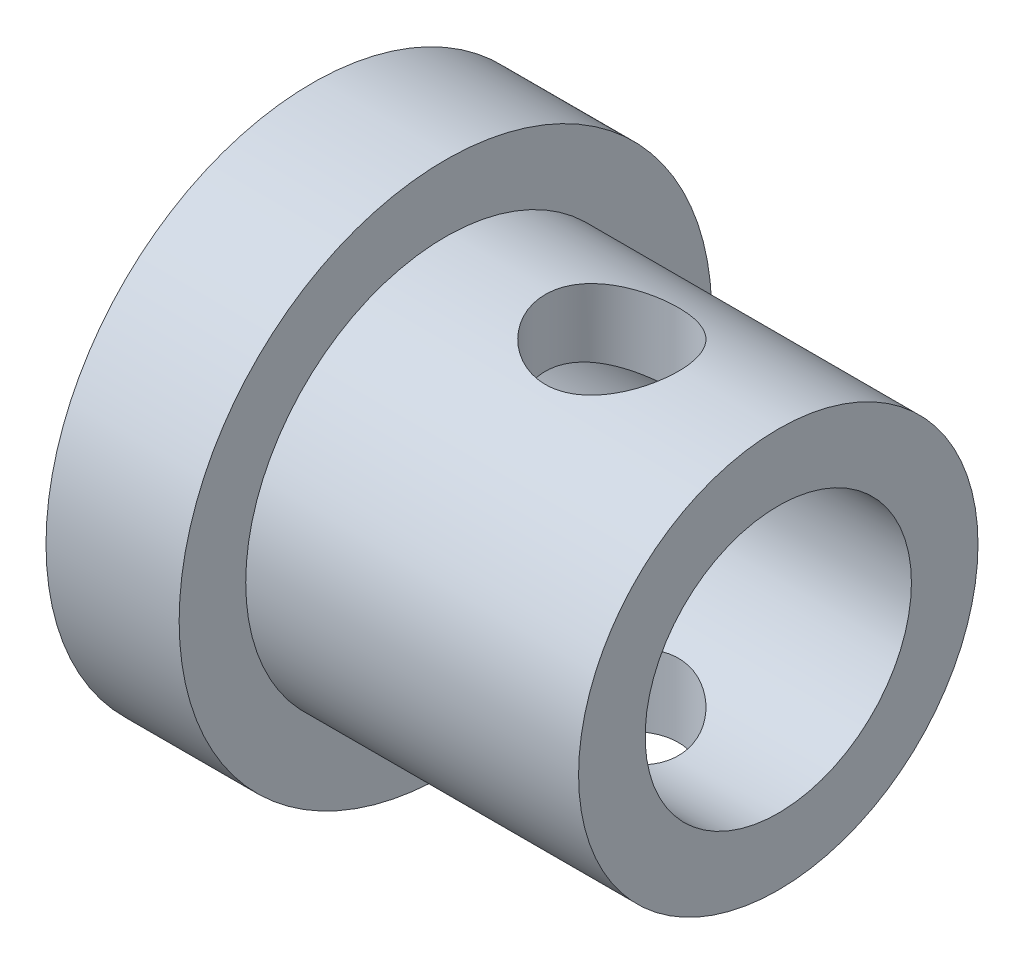
ISO-10303-21;
HEADER;
FILE_DESCRIPTION(('STEP AP214'),'2;1');
FILE_NAME('part.step','',(''),(''),'','','');
FILE_SCHEMA(('AUTOMOTIVE_DESIGN { 1 0 10303 214 1 1 1 1 }'));
ENDSEC;
DATA;
#1=APPLICATION_CONTEXT('core data for automotive mechanical design processes');
#2=APPLICATION_PROTOCOL_DEFINITION('international standard','automotive_design',2000,#1);
#3=PRODUCT_CONTEXT('',#1,'mechanical');
#4=PRODUCT('Part','Part','',(#3));
#5=PRODUCT_RELATED_PRODUCT_CATEGORY('part','',(#4));
#6=PRODUCT_DEFINITION_FORMATION('','',#4);
#7=PRODUCT_DEFINITION_CONTEXT('part definition',#1,'design');
#8=PRODUCT_DEFINITION('design','',#6,#7);
#9=PRODUCT_DEFINITION_SHAPE('','',#8);
#10=(LENGTH_UNIT() NAMED_UNIT(*) SI_UNIT(.MILLI.,.METRE.));
#11=(NAMED_UNIT(*) PLANE_ANGLE_UNIT() SI_UNIT($,.RADIAN.));
#12=(NAMED_UNIT(*) SI_UNIT($,.STERADIAN.) SOLID_ANGLE_UNIT());
#13=UNCERTAINTY_MEASURE_WITH_UNIT(LENGTH_MEASURE(1.E-05),#10,'distance_accuracy_value','');
#14=(GEOMETRIC_REPRESENTATION_CONTEXT(3) GLOBAL_UNCERTAINTY_ASSIGNED_CONTEXT((#13)) GLOBAL_UNIT_ASSIGNED_CONTEXT((#10,
#11,#12)) REPRESENTATION_CONTEXT('',''));
#15=CARTESIAN_POINT('',(0.,0.,0.));
#16=DIRECTION('',(0.,0.,1.));
#17=DIRECTION('',(1.,0.,0.));
#18=AXIS2_PLACEMENT_3D('',#15,#16,#17);
#19=CARTESIAN_POINT('',(3.5,0.,0.));
#20=DIRECTION('',(-1.,0.,0.));
#21=DIRECTION('',(0.,0.,1.));
#22=AXIS2_PLACEMENT_3D('',#19,#20,#21);
#23=CYLINDRICAL_SURFACE('',#22,3.);
#24=CARTESIAN_POINT('',(1.,-2.82842712474619,1.));
#25=CARTESIAN_POINT('',(1.05446817481068,-2.82842694532735,1.0000002579478));
#26=CARTESIAN_POINT('',(1.10893479977153,-2.83001769372806,0.99553478369814));
#27=CARTESIAN_POINT('',(1.21625442095062,-2.8361757417458,0.977851131702564));
#28=CARTESIAN_POINT('',(1.26910714986394,-2.8407435316722,0.964631512170673));
#29=CARTESIAN_POINT('',(1.37162689301281,-2.85228203663888,0.929955485680262));
#30=CARTESIAN_POINT('',(1.42129992944688,-2.8592480396464,0.908515221402));
#31=CARTESIAN_POINT('',(1.5163600485438,-2.87479122017008,0.858061628442627));
#32=CARTESIAN_POINT('',(1.5617461825525,-2.88336875305432,0.829046628860522));
#33=CARTESIAN_POINT('',(1.64871996233949,-2.90154489405589,0.763051146442527));
#34=CARTESIAN_POINT('',(1.69011542867204,-2.91116894844139,0.725824341377825));
#35=CARTESIAN_POINT('',(1.76620680122432,-2.93013864801508,0.644987667214489));
#36=CARTESIAN_POINT('',(1.80090163158228,-2.93948424829099,0.601376775052401));
#37=CARTESIAN_POINT('',(1.86347889732968,-2.95713866921658,0.507604507964983));
#38=CARTESIAN_POINT('',(1.89115997061798,-2.96541407701568,0.457301911224518));
#39=CARTESIAN_POINT('',(1.93759158512749,-2.97969586771021,0.352431222987481));
#40=CARTESIAN_POINT('',(1.9563445331769,-2.98570286203012,0.297864285687214));
#41=CARTESIAN_POINT('',(1.9837358546324,-2.99459075431897,0.188028817433492));
#42=CARTESIAN_POINT('',(1.99270344625701,-2.99757314777558,0.132850754852967));
#43=CARTESIAN_POINT('',(2.00131629336066,-3.00043608218249,0.0216978748240906));
#44=CARTESIAN_POINT('',(2.00096395165242,-3.00031742262891,-0.0342767335438934));
#45=CARTESIAN_POINT('',(1.99115574543397,-2.99706039618736,-0.143103515193818));
#46=CARTESIAN_POINT('',(1.98205747152549,-2.99404064755135,-0.195992048591668));
#47=CARTESIAN_POINT('',(1.95560701901955,-2.98546967339714,-0.299443438822161));
#48=CARTESIAN_POINT('',(1.93825428102024,-2.97991827631115,-0.350006137779176));
#49=CARTESIAN_POINT('',(1.89557868269387,-2.96675670293292,-0.448152474842014));
#50=CARTESIAN_POINT('',(1.87015406145322,-2.9591204252427,-0.495688220968999));
#51=CARTESIAN_POINT('',(1.81214029455161,-2.94258393038665,-0.58592432552717));
#52=CARTESIAN_POINT('',(1.77954915667336,-2.93368336200518,-0.62862333438477));
#53=CARTESIAN_POINT('',(1.70632560653926,-2.9150619185089,-0.710100866551907));
#54=CARTESIAN_POINT('',(1.66538684215456,-2.90532215172667,-0.748600157067556));
#55=CARTESIAN_POINT('',(1.57755127427734,-2.88647335245111,-0.81827725959589));
#56=CARTESIAN_POINT('',(1.53065355428676,-2.8773644173145,-0.849453943273005));
#57=CARTESIAN_POINT('',(1.43134637438458,-2.86070525135531,-0.903987455042732));
#58=CARTESIAN_POINT('',(1.37886786863219,-2.85317909338821,-0.927226463651049));
#59=CARTESIAN_POINT('',(1.27042860573374,-2.84081650878299,-0.964443193299507));
#60=CARTESIAN_POINT('',(1.21446931877818,-2.83597895501223,-0.978424795755529));
#61=CARTESIAN_POINT('',(1.10336164459938,-2.8297963630207,-0.996161282090474));
#62=CARTESIAN_POINT('',(1.04829057525428,-2.82830360315139,-1.00034909550575));
#63=CARTESIAN_POINT('',(0.938223850882962,-2.828566720628,-0.999605438911605));
#64=CARTESIAN_POINT('',(0.883228183975239,-2.83032200792768,-0.99467562522726));
#65=CARTESIAN_POINT('',(0.776843034288837,-2.83673618089379,-0.97622565155183));
#66=CARTESIAN_POINT('',(0.725394569849359,-2.84129325440593,-0.963006393980555));
#67=CARTESIAN_POINT('',(0.625456393760615,-2.8526855367127,-0.928713862560596));
#68=CARTESIAN_POINT('',(0.576967208409165,-2.85952114934907,-0.907639196363457));
#69=CARTESIAN_POINT('',(0.482619579153058,-2.87496877595718,-0.8574743407389));
#70=CARTESIAN_POINT('',(0.436893357358213,-2.8836302566561,-0.828151118358487));
#71=CARTESIAN_POINT('',(0.350853947616265,-2.90165768730984,-0.762585630557568));
#72=CARTESIAN_POINT('',(0.310542361338776,-2.911023844438,-0.726341325498784));
#73=CARTESIAN_POINT('',(0.234472015909365,-2.92995038637844,-0.645891705900322));
#74=CARTESIAN_POINT('',(0.199025609981151,-2.93949843577895,-0.601387270546651));
#75=CARTESIAN_POINT('',(0.136083857651955,-2.9572685161311,-0.506827291400257));
#76=CARTESIAN_POINT('',(0.108588228837575,-2.96549059417695,-0.456771944864552));
#77=CARTESIAN_POINT('',(0.062579895138285,-2.97964405810603,-0.352779862432295));
#78=CARTESIAN_POINT('',(0.0440087228519343,-2.98559030004531,-0.298871123321196));
#79=CARTESIAN_POINT('',(0.0162722579398949,-2.99458610837774,-0.188458465846016));
#80=CARTESIAN_POINT('',(0.00710357011949681,-2.99763672034018,-0.131955491953889));
#81=CARTESIAN_POINT('',(-0.00126207760564187,-3.00041863236257,-0.0208153358600406));
#82=CARTESIAN_POINT('',(-0.000907453932375802,-3.00029920089441,0.0337847239200191));
#83=CARTESIAN_POINT('',(0.00865730814640729,-2.99712196519396,0.142111145000174));
#84=CARTESIAN_POINT('',(0.0178667281527638,-2.99406439933567,0.195837576819055));
#85=CARTESIAN_POINT('',(0.0445822345759675,-2.98540914954421,0.300042119432061));
#86=CARTESIAN_POINT('',(0.0619542153529519,-2.9798525836118,0.350558270912795));
#87=CARTESIAN_POINT('',(0.104377531097136,-2.96677160704464,0.44797835093979));
#88=CARTESIAN_POINT('',(0.129430255196942,-2.95924684047901,0.49488162414241));
#89=CARTESIAN_POINT('',(0.187569512102081,-2.94265868828001,0.585634016308809));
#90=CARTESIAN_POINT('',(0.22091868538192,-2.93354872492381,0.629306251557697));
#91=CARTESIAN_POINT('',(0.294257391155915,-2.91492988791425,0.710581026272338));
#92=CARTESIAN_POINT('',(0.334249042261682,-2.90542088771397,0.748181621624259));
#93=CARTESIAN_POINT('',(0.421609355588035,-2.88663279827365,0.817741808833464));
#94=CARTESIAN_POINT('',(0.469205510980768,-2.87737727995345,0.849422965999216));
#95=CARTESIAN_POINT('',(0.569334426898652,-2.86060193316303,0.904314343299799));
#96=CARTESIAN_POINT('',(0.621865893014244,-2.8530816513617,0.927526776814559));
#97=CARTESIAN_POINT('',(0.727961824023833,-2.84101334230535,0.963843828206626));
#98=CARTESIAN_POINT('',(0.781372263565722,-2.83634632944799,0.977357909163268));
#99=CARTESIAN_POINT('',(0.889856050515475,-2.83005383613939,0.995434320161694));
#100=CARTESIAN_POINT('',(0.944928817435749,-2.82842730615135,0.999999739196502));
#101=CARTESIAN_POINT('',(1.,-2.82842712474619,1.));
#102=B_SPLINE_CURVE_WITH_KNOTS('',3,(#24,#25,#26,#27,#28,#29,#30,#31,#32,#33,#34,#35,#36,#37,
#38,#39,#40,#41,#42,#43,#44,#45,#46,#47,#48,#49,#50,#51,#52,#53,#54,#55,#56,#57,#58,#59,#60,#61,
#62,#63,#64,#65,#66,#67,#68,#69,#70,#71,#72,#73,#74,#75,#76,#77,#78,#79,#80,#81,#82,#83,#84,#85,
#86,#87,#88,#89,#90,#91,#92,#93,#94,#95,#96,#97,#98,#99,#100,#101),.UNSPECIFIED.,.T.,.F.,(4,2,2,
2,2,2,2,2,2,2,2,2,2,2,2,2,2,2,2,2,2,2,2,2,2,2,2,2,2,2,2,2,2,2,2,2,2,2,4),(0.,0.163200584775417,
0.32642805496888,0.489336627454544,0.652281166139159,0.821013374229398,0.989772651673597,
1.16293506139029,1.33605076382161,1.50314318760306,1.67019253297699,1.83069004820941,
1.99119844184608,2.15381654855707,2.31647991869394,2.48680174359289,2.65714979607478,
2.82992639837376,3.00263051349689,3.16754291357512,3.33242535830307,3.49164395761849,
3.65089079140019,3.81518857728788,3.979534856552,4.15178808164166,4.32403518750605,
4.49513791183924,4.66617882997229,4.82918084670708,4.99216964002854,5.15256956033503,
5.31299850756315,5.47935519513706,5.64576504425704,5.81868902729217,5.99156778259939,
6.15663212153686,6.32163947179229),.UNSPECIFIED.);
#103=CARTESIAN_POINT('',(1.,-2.82842712474619,1.));
#104=VERTEX_POINT('',#103);
#105=EDGE_CURVE('E78',#104,#104,#102,.T.);
#106=ORIENTED_EDGE('',*,*,#105,.T.);
#107=EDGE_LOOP('',(#106));
#108=FACE_BOUND('',#107,.T.);
#109=CARTESIAN_POINT('',(1.,2.82842712474619,1.));
#110=CARTESIAN_POINT('',(0.945531825189323,2.82842694532735,1.0000002579478));
#111=CARTESIAN_POINT('',(0.891065200228475,2.83001769372806,0.99553478369814));
#112=CARTESIAN_POINT('',(0.783745579049384,2.8361757417458,0.977851131702564));
#113=CARTESIAN_POINT('',(0.730892850136063,2.8407435316722,0.964631512170674));
#114=CARTESIAN_POINT('',(0.628373106987187,2.85228203663888,0.929955485680263));
#115=CARTESIAN_POINT('',(0.578700070553118,2.8592480396464,0.908515221402));
#116=CARTESIAN_POINT('',(0.483639951456205,2.87479122017008,0.858061628442627));
#117=CARTESIAN_POINT('',(0.438253817447503,2.88336875305432,0.829046628860523));
#118=CARTESIAN_POINT('',(0.351280037660512,2.90154489405589,0.763051146442527));
#119=CARTESIAN_POINT('',(0.309884571327957,2.91116894844139,0.725824341377825));
#120=CARTESIAN_POINT('',(0.233793198775676,2.93013864801508,0.644987667214489));
#121=CARTESIAN_POINT('',(0.199098368417716,2.93948424829099,0.601376775052402));
#122=CARTESIAN_POINT('',(0.136521102670319,2.95713866921658,0.507604507964984));
#123=CARTESIAN_POINT('',(0.108840029382019,2.96541407701568,0.457301911224518));
#124=CARTESIAN_POINT('',(0.0624084148725132,2.9796958677102,0.352431222987481));
#125=CARTESIAN_POINT('',(0.0436554668231001,2.98570286203012,0.297864285687214));
#126=CARTESIAN_POINT('',(0.0162641453676014,2.99459075431897,0.188028817433493));
#127=CARTESIAN_POINT('',(0.00729655374299271,2.99757314777558,0.132850754852967));
#128=CARTESIAN_POINT('',(-0.0013162933606595,3.00043608218249,0.0216978748240912));
#129=CARTESIAN_POINT('',(-0.000963951652417497,3.00031742262891,-0.0342767335438928));
#130=CARTESIAN_POINT('',(0.00884425456603261,2.99706039618736,-0.143103515193817));
#131=CARTESIAN_POINT('',(0.0179425284745069,2.99404064755135,-0.195992048591667));
#132=CARTESIAN_POINT('',(0.0443929809804537,2.98546967339714,-0.299443438822161));
#133=CARTESIAN_POINT('',(0.0617457189797547,2.97991827631115,-0.350006137779175));
#134=CARTESIAN_POINT('',(0.104421317306129,2.96675670293292,-0.448152474842013));
#135=CARTESIAN_POINT('',(0.129845938546777,2.9591204252427,-0.495688220968998));
#136=CARTESIAN_POINT('',(0.18785970544839,2.94258393038665,-0.585924325527169));
#137=CARTESIAN_POINT('',(0.220450843326638,2.93368336200518,-0.628623334384769));
#138=CARTESIAN_POINT('',(0.293674393460737,2.9150619185089,-0.710100866551907));
#139=CARTESIAN_POINT('',(0.334613157845441,2.90532215172667,-0.748600157067556));
#140=CARTESIAN_POINT('',(0.422448725722657,2.88647335245111,-0.81827725959589));
#141=CARTESIAN_POINT('',(0.469346445713238,2.8773644173145,-0.849453943273005));
#142=CARTESIAN_POINT('',(0.568653625615415,2.86070525135531,-0.903987455042732));
#143=CARTESIAN_POINT('',(0.621132131367812,2.85317909338821,-0.927226463651049));
#144=CARTESIAN_POINT('',(0.729571394266262,2.84081650878299,-0.964443193299507));
#145=CARTESIAN_POINT('',(0.785530681221824,2.83597895501223,-0.978424795755529));
#146=CARTESIAN_POINT('',(0.896638355400619,2.8297963630207,-0.996161282090474));
#147=CARTESIAN_POINT('',(0.951709424745724,2.82830360315139,-1.00034909550575));
#148=CARTESIAN_POINT('',(1.06177614911704,2.828566720628,-0.999605438911605));
#149=CARTESIAN_POINT('',(1.11677181602476,2.83032200792768,-0.99467562522726));
#150=CARTESIAN_POINT('',(1.22315696571116,2.83673618089379,-0.97622565155183));
#151=CARTESIAN_POINT('',(1.27460543015064,2.84129325440593,-0.963006393980555));
#152=CARTESIAN_POINT('',(1.37454360623938,2.8526855367127,-0.928713862560596));
#153=CARTESIAN_POINT('',(1.42303279159083,2.85952114934907,-0.907639196363457));
#154=CARTESIAN_POINT('',(1.51738042084694,2.87496877595718,-0.857474340738901));
#155=CARTESIAN_POINT('',(1.56310664264179,2.8836302566561,-0.828151118358487));
#156=CARTESIAN_POINT('',(1.64914605238373,2.90165768730984,-0.762585630557568));
#157=CARTESIAN_POINT('',(1.68945763866122,2.91102384443799,-0.726341325498785));
#158=CARTESIAN_POINT('',(1.76552798409063,2.92995038637844,-0.645891705900323));
#159=CARTESIAN_POINT('',(1.80097439001885,2.93949843577895,-0.601387270546652));
#160=CARTESIAN_POINT('',(1.86391614234804,2.9572685161311,-0.506827291400258));
#161=CARTESIAN_POINT('',(1.89141177116242,2.96549059417695,-0.456771944864553));
#162=CARTESIAN_POINT('',(1.93742010486171,2.97964405810603,-0.352779862432296));
#163=CARTESIAN_POINT('',(1.95599127714807,2.98559030004531,-0.298871123321197));
#164=CARTESIAN_POINT('',(1.9837277420601,2.99458610837774,-0.188458465846017));
#165=CARTESIAN_POINT('',(1.9928964298805,2.99763672034018,-0.13195549195389));
#166=CARTESIAN_POINT('',(2.00126207760564,3.00041863236257,-0.0208153358600409));
#167=CARTESIAN_POINT('',(2.00090745393238,3.00029920089441,0.0337847239200188));
#168=CARTESIAN_POINT('',(1.99134269185359,2.99712196519396,0.142111145000173));
#169=CARTESIAN_POINT('',(1.98213327184724,2.99406439933567,0.195837576819055));
#170=CARTESIAN_POINT('',(1.95541776542403,2.98540914954421,0.30004211943206));
#171=CARTESIAN_POINT('',(1.93804578464705,2.9798525836118,0.350558270912795));
#172=CARTESIAN_POINT('',(1.89562246890286,2.96677160704464,0.447978350939789));
#173=CARTESIAN_POINT('',(1.87056974480306,2.95924684047901,0.494881624142409));
#174=CARTESIAN_POINT('',(1.81243048789792,2.94265868828001,0.585634016308809));
#175=CARTESIAN_POINT('',(1.77908131461808,2.93354872492381,0.629306251557696));
#176=CARTESIAN_POINT('',(1.70574260884409,2.91492988791425,0.710581026272338));
#177=CARTESIAN_POINT('',(1.66575095773832,2.90542088771397,0.748181621624259));
#178=CARTESIAN_POINT('',(1.57839064441197,2.88663279827365,0.817741808833464));
#179=CARTESIAN_POINT('',(1.53079448901923,2.87737727995345,0.849422965999216));
#180=CARTESIAN_POINT('',(1.43066557310135,2.86060193316303,0.904314343299799));
#181=CARTESIAN_POINT('',(1.37813410698576,2.8530816513617,0.927526776814559));
#182=CARTESIAN_POINT('',(1.27203817597617,2.84101334230535,0.963843828206626));
#183=CARTESIAN_POINT('',(1.21862773643428,2.83634632944799,0.977357909163268));
#184=CARTESIAN_POINT('',(1.11014394948452,2.83005383613939,0.995434320161694));
#185=CARTESIAN_POINT('',(1.05507118256425,2.82842730615135,0.999999739196502));
#186=CARTESIAN_POINT('',(1.,2.82842712474619,1.));
#187=B_SPLINE_CURVE_WITH_KNOTS('',3,(#109,#110,#111,#112,#113,#114,#115,#116,#117,#118,#119,
#120,#121,#122,#123,#124,#125,#126,#127,#128,#129,#130,#131,#132,#133,#134,#135,#136,#137,#138,
#139,#140,#141,#142,#143,#144,#145,#146,#147,#148,#149,#150,#151,#152,#153,#154,#155,#156,#157,
#158,#159,#160,#161,#162,#163,#164,#165,#166,#167,#168,#169,#170,#171,#172,#173,#174,#175,#176,
#177,#178,#179,#180,#181,#182,#183,#184,#185,#186),.UNSPECIFIED.,.T.,.F.,(4,2,2,2,2,2,2,2,2,2,2,
2,2,2,2,2,2,2,2,2,2,2,2,2,2,2,2,2,2,2,2,2,2,2,2,2,2,2,4),(0.,0.163200584775417,0.32642805496888,
0.489336627454544,0.652281166139158,0.821013374229398,0.989772651673596,1.16293506139029,
1.33605076382161,1.50314318760306,1.67019253297699,1.83069004820941,1.99119844184608,
2.15381654855707,2.31647991869394,2.48680174359289,2.65714979607478,2.82992639837376,
3.00263051349688,3.16754291357512,3.33242535830307,3.49164395761849,3.65089079140019,
3.81518857728788,3.979534856552,4.15178808164165,4.32403518750605,4.49513791183924,
4.66617882997229,4.82918084670708,4.99216964002854,5.15256956033503,5.31299850756315,
5.47935519513707,5.64576504425704,5.81868902729217,5.9915677825994,6.15663212153686,
6.32163947179229),.UNSPECIFIED.);
#188=CARTESIAN_POINT('',(1.,2.82842712474619,1.));
#189=VERTEX_POINT('',#188);
#190=EDGE_CURVE('E73',#189,#189,#187,.T.);
#191=ORIENTED_EDGE('',*,*,#190,.T.);
#192=EDGE_LOOP('',(#191));
#193=FACE_BOUND('',#192,.T.);
#194=CARTESIAN_POINT('',(3.5,0.,0.));
#195=DIRECTION('',(1.,0.,0.));
#196=DIRECTION('',(0.,0.,-1.));
#197=AXIS2_PLACEMENT_3D('',#194,#195,#196);
#198=CIRCLE('',#197,3.);
#199=CARTESIAN_POINT('',(3.5,0.,-3.));
#200=VERTEX_POINT('',#199);
#201=EDGE_CURVE('E47',#200,#200,#198,.T.);
#202=ORIENTED_EDGE('',*,*,#201,.F.);
#203=EDGE_LOOP('',(#202));
#204=FACE_BOUND('',#203,.T.);
#205=CARTESIAN_POINT('',(-1.5,0.,0.));
#206=DIRECTION('',(-1.,0.,0.));
#207=DIRECTION('',(0.,0.,1.));
#208=AXIS2_PLACEMENT_3D('',#205,#206,#207);
#209=CIRCLE('',#208,3.);
#210=CARTESIAN_POINT('',(-1.5,0.,3.));
#211=VERTEX_POINT('',#210);
#212=EDGE_CURVE('E10',#211,#211,#209,.T.);
#213=ORIENTED_EDGE('',*,*,#212,.F.);
#214=EDGE_LOOP('',(#213));
#215=FACE_BOUND('',#214,.T.);
#216=ADVANCED_FACE('F34',(#108,#193,#204,#215),#23,.T.);
#217=CARTESIAN_POINT('',(3.5,0.,0.));
#218=DIRECTION('',(1.,0.,0.));
#219=DIRECTION('',(0.,0.,-1.));
#220=AXIS2_PLACEMENT_3D('',#217,#218,#219);
#221=PLANE('',#220);
#222=CARTESIAN_POINT('',(3.5,0.,0.));
#223=DIRECTION('',(1.,0.,0.));
#224=DIRECTION('',(0.,0.,-1.));
#225=AXIS2_PLACEMENT_3D('',#222,#223,#224);
#226=CIRCLE('',#225,2.);
#227=CARTESIAN_POINT('',(3.5,0.,-2.));
#228=VERTEX_POINT('',#227);
#229=EDGE_CURVE('E84',#228,#228,#226,.T.);
#230=ORIENTED_EDGE('',*,*,#229,.F.);
#231=EDGE_LOOP('',(#230));
#232=FACE_BOUND('',#231,.T.);
#233=ORIENTED_EDGE('',*,*,#201,.T.);
#234=EDGE_LOOP('',(#233));
#235=FACE_BOUND('',#234,.T.);
#236=ADVANCED_FACE('F100',(#232,#235),#221,.T.);
#237=CARTESIAN_POINT('',(-1.5,0.,0.));
#238=DIRECTION('',(-1.,0.,0.));
#239=DIRECTION('',(0.,0.,1.));
#240=AXIS2_PLACEMENT_3D('',#237,#238,#239);
#241=CYLINDRICAL_SURFACE('',#240,4.);
#242=CARTESIAN_POINT('',(-1.5,0.,0.));
#243=DIRECTION('',(-1.,0.,0.));
#244=DIRECTION('',(0.,0.,1.));
#245=AXIS2_PLACEMENT_3D('',#242,#243,#244);
#246=CIRCLE('',#245,4.);
#247=CARTESIAN_POINT('',(-1.5,0.,4.));
#248=VERTEX_POINT('',#247);
#249=EDGE_CURVE('E52',#248,#248,#246,.T.);
#250=ORIENTED_EDGE('',*,*,#249,.T.);
#251=EDGE_LOOP('',(#250));
#252=FACE_BOUND('',#251,.T.);
#253=CARTESIAN_POINT('',(-3.5,0.,0.));
#254=DIRECTION('',(-1.,0.,0.));
#255=DIRECTION('',(0.,0.,1.));
#256=AXIS2_PLACEMENT_3D('',#253,#254,#255);
#257=CIRCLE('',#256,4.);
#258=CARTESIAN_POINT('',(-3.5,0.,4.));
#259=VERTEX_POINT('',#258);
#260=EDGE_CURVE('E88',#259,#259,#257,.T.);
#261=ORIENTED_EDGE('',*,*,#260,.F.);
#262=EDGE_LOOP('',(#261));
#263=FACE_BOUND('',#262,.T.);
#264=ADVANCED_FACE('F97',(#252,#263),#241,.T.);
#265=CARTESIAN_POINT('',(-1.5,0.,0.));
#266=DIRECTION('',(-1.,0.,0.));
#267=DIRECTION('',(0.,0.,1.));
#268=AXIS2_PLACEMENT_3D('',#265,#266,#267);
#269=PLANE('',#268);
#270=ORIENTED_EDGE('',*,*,#212,.T.);
#271=EDGE_LOOP('',(#270));
#272=FACE_BOUND('',#271,.T.);
#273=ORIENTED_EDGE('',*,*,#249,.F.);
#274=EDGE_LOOP('',(#273));
#275=FACE_BOUND('',#274,.T.);
#276=ADVANCED_FACE('F99',(#272,#275),#269,.F.);
#277=CARTESIAN_POINT('',(-3.5,0.,0.));
#278=DIRECTION('',(1.,0.,0.));
#279=DIRECTION('',(0.,0.,-1.));
#280=AXIS2_PLACEMENT_3D('',#277,#278,#279);
#281=PLANE('',#280);
#282=CARTESIAN_POINT('',(-3.5,0.,0.));
#283=DIRECTION('',(1.,0.,0.));
#284=DIRECTION('',(0.,0.,-1.));
#285=AXIS2_PLACEMENT_3D('',#282,#283,#284);
#286=CIRCLE('',#285,2.);
#287=CARTESIAN_POINT('',(-3.5,0.,-2.));
#288=VERTEX_POINT('',#287);
#289=EDGE_CURVE('E85',#288,#288,#286,.T.);
#290=ORIENTED_EDGE('',*,*,#289,.T.);
#291=EDGE_LOOP('',(#290));
#292=FACE_BOUND('',#291,.T.);
#293=ORIENTED_EDGE('',*,*,#260,.T.);
#294=EDGE_LOOP('',(#293));
#295=FACE_BOUND('',#294,.T.);
#296=ADVANCED_FACE('F95',(#292,#295),#281,.F.);
#297=CARTESIAN_POINT('',(-3.5,0.,0.));
#298=DIRECTION('',(1.,0.,0.));
#299=DIRECTION('',(0.,0.,-1.));
#300=AXIS2_PLACEMENT_3D('',#297,#298,#299);
#301=CYLINDRICAL_SURFACE('',#300,2.);
#302=CARTESIAN_POINT('',(1.,-1.73205080756888,1.));
#303=CARTESIAN_POINT('',(0.94789219180475,-1.73205534728459,0.999996363074532));
#304=CARTESIAN_POINT('',(0.895718588474954,-1.73443801187756,0.995899970733217));
#305=CARTESIAN_POINT('',(0.792972735322847,-1.74362366452052,0.979723209898053));
#306=CARTESIAN_POINT('',(0.742404084956592,-1.75043594055559,0.967626064554179));
#307=CARTESIAN_POINT('',(0.644548335656059,-1.76749346605398,0.936099948699812));
#308=CARTESIAN_POINT('',(0.597245347526413,-1.77772043473252,0.916709952493731));
#309=CARTESIAN_POINT('',(0.50657579800328,-1.80042664816858,0.871267525376372));
#310=CARTESIAN_POINT('',(0.463209449737542,-1.81290601476065,0.845214734035773));
#311=CARTESIAN_POINT('',(0.377694271442494,-1.83996869057441,0.784666540530879));
#312=CARTESIAN_POINT('',(0.335940864326456,-1.85464063637954,0.74965203614377));
#313=CARTESIAN_POINT('',(0.25859161159329,-1.88371982785706,0.673253807614468));
#314=CARTESIAN_POINT('',(0.222998837416479,-1.8981269383125,0.631866925782293));
#315=CARTESIAN_POINT('',(0.156632848852337,-1.92621476952949,0.540489563414546));
#316=CARTESIAN_POINT('',(0.12634623214047,-1.93978106418172,0.490107189012575));
#317=CARTESIAN_POINT('',(0.0748591467542373,-1.96350756099529,0.384157026599504));
#318=CARTESIAN_POINT('',(0.0536529438628296,-1.97366991183742,0.328592538138155));
#319=CARTESIAN_POINT('',(0.0224953386989024,-1.98880461244237,0.218044943925977));
#320=CARTESIAN_POINT('',(0.0118504736444666,-1.99409480220892,0.163301790488817));
#321=CARTESIAN_POINT('',(-0.000166118675038273,-2.00007583846067,0.0525706286978478));
#322=CARTESIAN_POINT('',(-0.00154345679571052,-2.0007694678459,-0.0034166058437388));
#323=CARTESIAN_POINT('',(0.0047466739703493,-1.9976298191645,-0.10983252442375));
#324=CARTESIAN_POINT('',(0.0116380155212225,-1.9941849589216,-0.160321199176792));
#325=CARTESIAN_POINT('',(0.0328808439046571,-1.98374245259747,-0.259313771918322));
#326=CARTESIAN_POINT('',(0.0472328889762229,-1.97674454066394,-0.307817521093926));
#327=CARTESIAN_POINT('',(0.0830825660898132,-1.95971583287654,-0.402309391569554));
#328=CARTESIAN_POINT('',(0.104676313172067,-1.94964441529199,-0.448253423515179));
#329=CARTESIAN_POINT('',(0.154263416201493,-1.92737645986687,-0.535976801513329));
#330=CARTESIAN_POINT('',(0.18225906330235,-1.91517916157484,-0.577754648838646));
#331=CARTESIAN_POINT('',(0.246895351533015,-1.88844394399229,-0.660173660898195));
#332=CARTESIAN_POINT('',(0.28410302832601,-1.87379375998175,-0.700334075029361));
#333=CARTESIAN_POINT('',(0.364589724930177,-1.84454340586812,-0.77410437029778));
#334=CARTESIAN_POINT('',(0.407873372274063,-1.82994328265629,-0.807709211574231));
#335=CARTESIAN_POINT('',(0.502648192424087,-1.80144156092485,-0.869505334642212));
#336=CARTESIAN_POINT('',(0.554486023054211,-1.78764319990708,-0.897217314978052));
#337=CARTESIAN_POINT('',(0.662937671358998,-1.76375450278576,-0.943319113001232));
#338=CARTESIAN_POINT('',(0.719546433017562,-1.75366030046067,-0.96171865821089));
#339=CARTESIAN_POINT('',(0.831214511282791,-1.73944635817034,-0.987180211025041));
#340=CARTESIAN_POINT('',(0.886041119043552,-1.73491655848496,-0.995025122119976));
#341=CARTESIAN_POINT('',(0.996401341516542,-1.7311791936161,-1.00151694661143));
#342=CARTESIAN_POINT('',(1.05193442911979,-1.73196786889312,-1.00017035731503));
#343=CARTESIAN_POINT('',(1.15565391857873,-1.73834336540585,-0.989036043343966));
#344=CARTESIAN_POINT('',(1.20397945110793,-1.74339587506654,-0.980187816712467));
#345=CARTESIAN_POINT('',(1.29836778627096,-1.75694021551341,-0.955696284632441));
#346=CARTESIAN_POINT('',(1.34442985074661,-1.76543316005034,-0.940050778623614));
#347=CARTESIAN_POINT('',(1.4354113309027,-1.78536222079657,-0.901647588604886));
#348=CARTESIAN_POINT('',(1.48017901685355,-1.79691643243063,-0.878594063692723));
#349=CARTESIAN_POINT('',(1.56546927153899,-1.8215611949725,-0.826287064015804));
#350=CARTESIAN_POINT('',(1.60598964351328,-1.83465253355148,-0.797030404332216));
#351=CARTESIAN_POINT('',(1.68697876752355,-1.86287998456336,-0.728837167198853));
#352=CARTESIAN_POINT('',(1.72679715071766,-1.87806583154289,-0.689145272314967));
#353=CARTESIAN_POINT('',(1.79941223799359,-1.90734234977893,-0.603404495398289));
#354=CARTESIAN_POINT('',(1.83220657023054,-1.92143265007709,-0.557353474655347));
#355=CARTESIAN_POINT('',(1.8905737259501,-1.94741361690957,-0.458535362558757));
#356=CARTESIAN_POINT('',(1.91593311821091,-1.95923641672029,-0.405623097574113));
#357=CARTESIAN_POINT('',(1.95713790385739,-1.97883354959301,-0.295522364641082));
#358=CARTESIAN_POINT('',(1.97299165136631,-1.98661143676373,-0.238337701392176));
#359=CARTESIAN_POINT('',(1.99336856417466,-1.99667508181883,-0.126979682330417));
#360=CARTESIAN_POINT('',(1.99879787587611,-1.99939927908191,-0.0730114438504569));
#361=CARTESIAN_POINT('',(2.0008432654544,-2.00042130375131,0.0351259859512038));
#362=CARTESIAN_POINT('',(1.99746242852356,-1.9987206806689,0.089295100295087));
#363=CARTESIAN_POINT('',(1.98258359320438,-1.99133968837923,0.192537992317147));
#364=CARTESIAN_POINT('',(1.97163515074233,-1.9859289466799,0.241712317811264));
#365=CARTESIAN_POINT('',(1.94267300069703,-1.97192093663423,0.337445952183618));
#366=CARTESIAN_POINT('',(1.92465827990655,-1.96332321132796,0.384004884955509));
#367=CARTESIAN_POINT('',(1.88127294783403,-1.9432593074812,0.475423406244885));
#368=CARTESIAN_POINT('',(1.85562067679216,-1.93168617198799,0.520125142700047));
#369=CARTESIAN_POINT('',(1.79804206914095,-1.90688133141826,0.604774641814025));
#370=CARTESIAN_POINT('',(1.76611285088433,-1.89364886558361,0.644720207414908));
#371=CARTESIAN_POINT('',(1.6932028609773,-1.86528610226628,0.722914004156892));
#372=CARTESIAN_POINT('',(1.65163751252281,-1.85009799011698,0.760597684539272));
#373=CARTESIAN_POINT('',(1.56254927887023,-1.82063076162852,0.828663287394675));
#374=CARTESIAN_POINT('',(1.51502117913232,-1.80635245761865,0.859038750010059));
#375=CARTESIAN_POINT('',(1.41336335341904,-1.77999605304916,0.912431079785655));
#376=CARTESIAN_POINT('',(1.35907246887126,-1.7680017425627,0.93518506596094));
#377=CARTESIAN_POINT('',(1.24666759566022,-1.74866156328351,0.970878709506412));
#378=CARTESIAN_POINT('',(1.18856711108731,-1.74130016147702,0.983851191175347));
#379=CARTESIAN_POINT('',(1.108194644348,-1.7352927260179,0.994367007864415));
#380=CARTESIAN_POINT('',(1.08663210560212,-1.73408129005152,0.996476104963851));
#381=CARTESIAN_POINT('',(1.04338351931776,-1.7324593588775,0.999293405089963));
#382=CARTESIAN_POINT('',(1.02169746361413,-1.73204891725109,1.00000151439987));
#383=CARTESIAN_POINT('',(1.,-1.73205080756888,1.));
#384=B_SPLINE_CURVE_WITH_KNOTS('',3,(#302,#303,#304,#305,#306,#307,#308,#309,#310,#311,#312,
#313,#314,#315,#316,#317,#318,#319,#320,#321,#322,#323,#324,#325,#326,#327,#328,#329,#330,#331,
#332,#333,#334,#335,#336,#337,#338,#339,#340,#341,#342,#343,#344,#345,#346,#347,#348,#349,#350,
#351,#352,#353,#354,#355,#356,#357,#358,#359,#360,#361,#362,#363,#364,#365,#366,#367,#368,#369,
#370,#371,#372,#373,#374,#375,#376,#377,#378,#379,#380,#381,#382,#383),.UNSPECIFIED.,.T.,.F.,(4,
2,2,2,2,2,2,2,2,2,2,2,2,2,2,2,2,2,2,2,2,2,2,2,2,2,2,2,2,2,2,2,2,2,2,2,2,2,2,2,4),(0.,
0.156232122594716,0.312792892824805,0.468528595918886,0.62427272544515,0.792862312498234,
0.96153571084371,1.14157892238764,1.32150826963891,1.48863484967935,1.6556602368604,
1.80816097484538,1.96067312517455,2.11529534731147,2.26997299350272,2.43927191456891,
2.60870048245919,2.78888841729448,2.96888774211705,3.13462290854212,3.30024093188373,
3.44774183424026,3.59529052436063,3.74967296406088,3.90413486220047,4.07806743580613,
4.25205864978202,4.43064181412966,4.60906779808772,4.77112270389487,4.93312086793972,
5.08444424871492,5.23578933512013,5.39360750719472,5.55149830100719,5.72510241850068,
5.89885942845154,6.07810749038605,6.2567513300276,6.32180135185309,6.38685572494541),.UNSPECIFIED.);
#385=CARTESIAN_POINT('',(1.,-1.73205080756888,1.));
#386=VERTEX_POINT('',#385);
#387=EDGE_CURVE('E38',#386,#386,#384,.T.);
#388=ORIENTED_EDGE('',*,*,#387,.T.);
#389=EDGE_LOOP('',(#388));
#390=FACE_BOUND('',#389,.T.);
#391=CARTESIAN_POINT('',(1.,1.73205080756888,1.));
#392=CARTESIAN_POINT('',(1.05210780819525,1.73205534728459,0.999996363074532));
#393=CARTESIAN_POINT('',(1.10428141152505,1.73443801187756,0.995899970733217));
#394=CARTESIAN_POINT('',(1.20702726467715,1.74362366452052,0.979723209898053));
#395=CARTESIAN_POINT('',(1.25759591504341,1.75043594055559,0.967626064554179));
#396=CARTESIAN_POINT('',(1.35545166434394,1.76749346605398,0.936099948699812));
#397=CARTESIAN_POINT('',(1.40275465247359,1.77772043473252,0.916709952493731));
#398=CARTESIAN_POINT('',(1.49342420199672,1.80042664816858,0.871267525376372));
#399=CARTESIAN_POINT('',(1.53679055026246,1.81290601476065,0.845214734035773));
#400=CARTESIAN_POINT('',(1.62230572855751,1.83996869057441,0.784666540530879));
#401=CARTESIAN_POINT('',(1.66405913567354,1.85464063637954,0.74965203614377));
#402=CARTESIAN_POINT('',(1.74140838840671,1.88371982785706,0.673253807614468));
#403=CARTESIAN_POINT('',(1.77700116258352,1.8981269383125,0.631866925782293));
#404=CARTESIAN_POINT('',(1.84336715114766,1.92621476952949,0.540489563414546));
#405=CARTESIAN_POINT('',(1.87365376785953,1.93978106418172,0.490107189012575));
#406=CARTESIAN_POINT('',(1.92514085324576,1.96350756099529,0.384157026599504));
#407=CARTESIAN_POINT('',(1.94634705613717,1.97366991183742,0.328592538138155));
#408=CARTESIAN_POINT('',(1.9775046613011,1.98880461244237,0.218044943925977));
#409=CARTESIAN_POINT('',(1.98814952635553,1.99409480220892,0.163301790488817));
#410=CARTESIAN_POINT('',(2.00016611867504,2.00007583846067,0.0525706286978479));
#411=CARTESIAN_POINT('',(2.00154345679571,2.0007694678459,-0.00341660584373873));
#412=CARTESIAN_POINT('',(1.99525332602965,1.9976298191645,-0.10983252442375));
#413=CARTESIAN_POINT('',(1.98836198447878,1.9941849589216,-0.160321199176792));
#414=CARTESIAN_POINT('',(1.96711915609534,1.98374245259747,-0.259313771918322));
#415=CARTESIAN_POINT('',(1.95276711102378,1.97674454066394,-0.307817521093926));
#416=CARTESIAN_POINT('',(1.91691743391019,1.95971583287654,-0.402309391569554));
#417=CARTESIAN_POINT('',(1.89532368682793,1.94964441529199,-0.448253423515179));
#418=CARTESIAN_POINT('',(1.84573658379851,1.92737645986687,-0.535976801513329));
#419=CARTESIAN_POINT('',(1.81774093669765,1.91517916157484,-0.577754648838646));
#420=CARTESIAN_POINT('',(1.75310464846698,1.88844394399229,-0.660173660898195));
#421=CARTESIAN_POINT('',(1.71589697167399,1.87379375998175,-0.700334075029361));
#422=CARTESIAN_POINT('',(1.63541027506982,1.84454340586812,-0.774104370297781));
#423=CARTESIAN_POINT('',(1.59212662772594,1.82994328265629,-0.807709211574231));
#424=CARTESIAN_POINT('',(1.49735180757591,1.80144156092485,-0.869505334642212));
#425=CARTESIAN_POINT('',(1.44551397694579,1.78764319990707,-0.897217314978052));
#426=CARTESIAN_POINT('',(1.337062328641,1.76375450278576,-0.943319113001232));
#427=CARTESIAN_POINT('',(1.28045356698244,1.75366030046067,-0.96171865821089));
#428=CARTESIAN_POINT('',(1.16878548871721,1.73944635817034,-0.987180211025041));
#429=CARTESIAN_POINT('',(1.11395888095645,1.73491655848496,-0.995025122119976));
#430=CARTESIAN_POINT('',(1.00359865848346,1.73117919361609,-1.00151694661143));
#431=CARTESIAN_POINT('',(0.948065570880213,1.73196786889312,-1.00017035731503));
#432=CARTESIAN_POINT('',(0.844346081421271,1.73834336540585,-0.989036043343966));
#433=CARTESIAN_POINT('',(0.796020548892072,1.74339587506654,-0.980187816712467));
#434=CARTESIAN_POINT('',(0.701632213729041,1.75694021551341,-0.955696284632441));
#435=CARTESIAN_POINT('',(0.655570149253392,1.76543316005034,-0.940050778623615));
#436=CARTESIAN_POINT('',(0.564588669097304,1.78536222079657,-0.901647588604886));
#437=CARTESIAN_POINT('',(0.519820983146448,1.79691643243063,-0.878594063692723));
#438=CARTESIAN_POINT('',(0.434530728461006,1.8215611949725,-0.826287064015805));
#439=CARTESIAN_POINT('',(0.394010356486717,1.83465253355148,-0.797030404332217));
#440=CARTESIAN_POINT('',(0.313021232476452,1.86287998456336,-0.728837167198854));
#441=CARTESIAN_POINT('',(0.273202849282341,1.87806583154289,-0.689145272314967));
#442=CARTESIAN_POINT('',(0.200587762006409,1.90734234977892,-0.603404495398289));
#443=CARTESIAN_POINT('',(0.16779342976946,1.92143265007709,-0.557353474655347));
#444=CARTESIAN_POINT('',(0.109426274049898,1.94741361690957,-0.458535362558758));
#445=CARTESIAN_POINT('',(0.0840668817890901,1.95923641672029,-0.405623097574113));
#446=CARTESIAN_POINT('',(0.0428620961426073,1.97883354959301,-0.295522364641082));
#447=CARTESIAN_POINT('',(0.027008348633695,1.98661143676373,-0.238337701392176));
#448=CARTESIAN_POINT('',(0.00663143582533808,1.99667508181883,-0.126979682330417));
#449=CARTESIAN_POINT('',(0.00120212412388615,1.99939927908191,-0.0730114438504573));
#450=CARTESIAN_POINT('',(-0.000843265454401555,2.00042130375131,0.0351259859512033));
#451=CARTESIAN_POINT('',(0.00253757147643598,1.9987206806689,0.0892951002950865));
#452=CARTESIAN_POINT('',(0.017416406795624,1.99133968837923,0.192537992317147));
#453=CARTESIAN_POINT('',(0.028364849257671,1.9859289466799,0.241712317811263));
#454=CARTESIAN_POINT('',(0.0573269993029705,1.97192093663423,0.337445952183617));
#455=CARTESIAN_POINT('',(0.0753417200934524,1.96332321132796,0.384004884955508));
#456=CARTESIAN_POINT('',(0.118727052165973,1.9432593074812,0.475423406244885));
#457=CARTESIAN_POINT('',(0.144379323207839,1.93168617198799,0.520125142700046));
#458=CARTESIAN_POINT('',(0.20195793085905,1.90688133141826,0.604774641814025));
#459=CARTESIAN_POINT('',(0.233887149115673,1.89364886558361,0.644720207414907));
#460=CARTESIAN_POINT('',(0.306797139022702,1.86528610226628,0.722914004156891));
#461=CARTESIAN_POINT('',(0.348362487477192,1.85009799011698,0.760597684539272));
#462=CARTESIAN_POINT('',(0.43745072112977,1.82063076162852,0.828663287394675));
#463=CARTESIAN_POINT('',(0.484978820867684,1.80635245761865,0.859038750010059));
#464=CARTESIAN_POINT('',(0.586636646580955,1.77999605304916,0.912431079785654));
#465=CARTESIAN_POINT('',(0.640927531128736,1.7680017425627,0.935185065960939));
#466=CARTESIAN_POINT('',(0.753332404339778,1.74866156328352,0.970878709506412));
#467=CARTESIAN_POINT('',(0.811432888912686,1.74130016147702,0.983851191175347));
#468=CARTESIAN_POINT('',(0.891805355651996,1.7352927260179,0.994367007864415));
#469=CARTESIAN_POINT('',(0.913367894397883,1.73408129005152,0.996476104963851));
#470=CARTESIAN_POINT('',(0.956616480682243,1.7324593588775,0.999293405089963));
#471=CARTESIAN_POINT('',(0.978302536385874,1.73204891725109,1.00000151439987));
#472=CARTESIAN_POINT('',(1.,1.73205080756888,1.));
#473=B_SPLINE_CURVE_WITH_KNOTS('',3,(#391,#392,#393,#394,#395,#396,#397,#398,#399,#400,#401,
#402,#403,#404,#405,#406,#407,#408,#409,#410,#411,#412,#413,#414,#415,#416,#417,#418,#419,#420,
#421,#422,#423,#424,#425,#426,#427,#428,#429,#430,#431,#432,#433,#434,#435,#436,#437,#438,#439,
#440,#441,#442,#443,#444,#445,#446,#447,#448,#449,#450,#451,#452,#453,#454,#455,#456,#457,#458,
#459,#460,#461,#462,#463,#464,#465,#466,#467,#468,#469,#470,#471,#472),.UNSPECIFIED.,.T.,.F.,(4,
2,2,2,2,2,2,2,2,2,2,2,2,2,2,2,2,2,2,2,2,2,2,2,2,2,2,2,2,2,2,2,2,2,2,2,2,2,2,2,4),(0.,
0.156232122594716,0.312792892824805,0.468528595918886,0.62427272544515,0.792862312498234,
0.96153571084371,1.14157892238763,1.32150826963891,1.48863484967935,1.6556602368604,
1.80816097484538,1.96067312517455,2.11529534731147,2.26997299350272,2.43927191456891,
2.60870048245919,2.78888841729448,2.96888774211705,3.13462290854212,3.30024093188373,
3.44774183424026,3.59529052436063,3.74967296406088,3.90413486220047,4.07806743580613,
4.25205864978202,4.43064181412966,4.60906779808772,4.77112270389487,4.93312086793972,
5.08444424871493,5.23578933512013,5.39360750719472,5.55149830100719,5.72510241850068,
5.89885942845155,6.07810749038605,6.25675133002761,6.3218013518531,6.38685572494541),.UNSPECIFIED.);
#474=CARTESIAN_POINT('',(1.,1.73205080756888,1.));
#475=VERTEX_POINT('',#474);
#476=EDGE_CURVE('E55',#475,#475,#473,.T.);
#477=ORIENTED_EDGE('',*,*,#476,.T.);
#478=EDGE_LOOP('',(#477));
#479=FACE_BOUND('',#478,.T.);
#480=ORIENTED_EDGE('',*,*,#289,.F.);
#481=EDGE_LOOP('',(#480));
#482=FACE_BOUND('',#481,.T.);
#483=ORIENTED_EDGE('',*,*,#229,.T.);
#484=EDGE_LOOP('',(#483));
#485=FACE_BOUND('',#484,.T.);
#486=ADVANCED_FACE('F60',(#390,#479,#482,#485),#301,.F.);
#487=CARTESIAN_POINT('',(1.,-4.,0.));
#488=DIRECTION('',(0.,1.,0.));
#489=DIRECTION('',(0.,0.,1.));
#490=AXIS2_PLACEMENT_3D('',#487,#488,#489);
#491=CYLINDRICAL_SURFACE('',#490,1.);
#492=ORIENTED_EDGE('',*,*,#476,.F.);
#493=EDGE_LOOP('',(#492));
#494=FACE_BOUND('',#493,.T.);
#495=ORIENTED_EDGE('',*,*,#190,.F.);
#496=EDGE_LOOP('',(#495));
#497=FACE_BOUND('',#496,.T.);
#498=ADVANCED_FACE('F66',(#494,#497),#491,.F.);
#499=ORIENTED_EDGE('',*,*,#387,.F.);
#500=EDGE_LOOP('',(#499));
#501=FACE_BOUND('',#500,.T.);
#502=ORIENTED_EDGE('',*,*,#105,.F.);
#503=EDGE_LOOP('',(#502));
#504=FACE_BOUND('',#503,.T.);
#505=ADVANCED_FACE('F63',(#501,#504),#491,.F.);
#506=CLOSED_SHELL('',(#216,#236,#264,#276,#296,#486,#498,#505));
#507=MANIFOLD_SOLID_BREP('B2',#506);
#508=ADVANCED_BREP_SHAPE_REPRESENTATION('',(#18,#507),#14);
#509=SHAPE_DEFINITION_REPRESENTATION(#9,#508);
ENDSEC;
END-ISO-10303-21;
